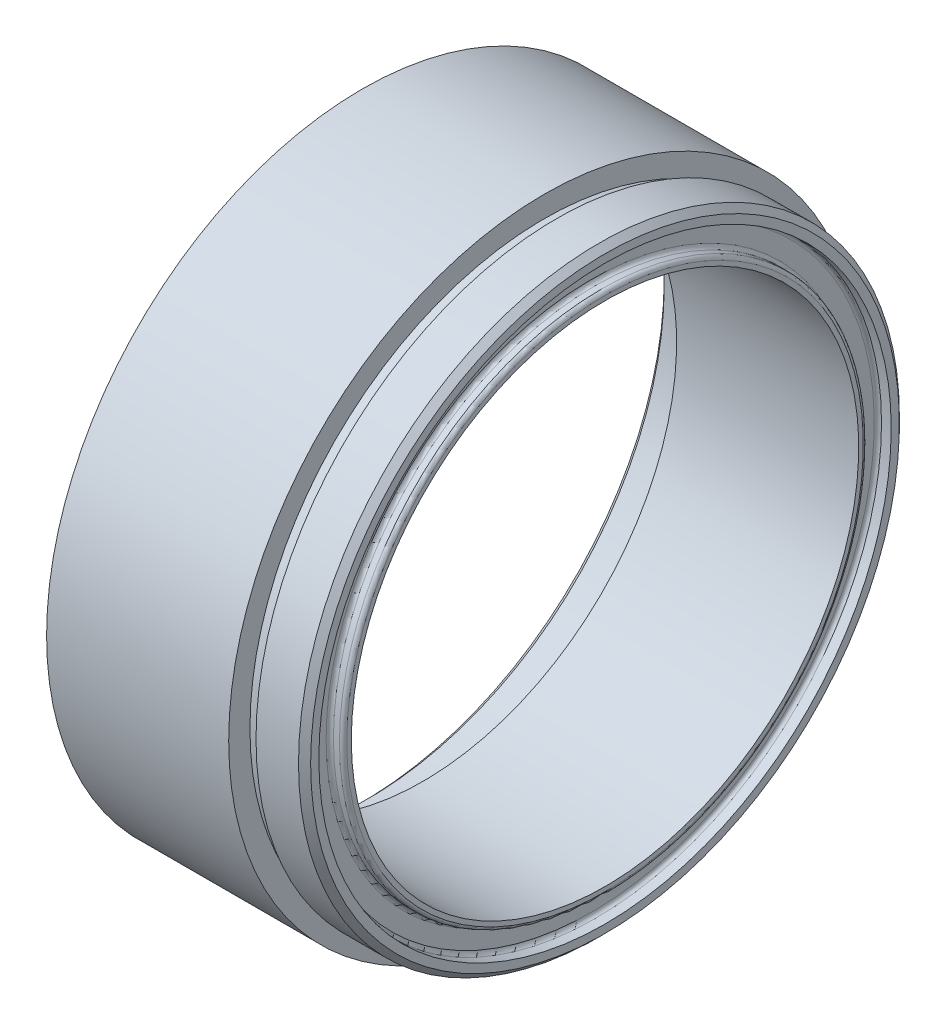
ISO-10303-21;
HEADER;
FILE_DESCRIPTION(('STEP AP214'),'2;1');
FILE_NAME('part.step','',(''),(''),'','','');
FILE_SCHEMA(('AUTOMOTIVE_DESIGN { 1 0 10303 214 1 1 1 1 }'));
ENDSEC;
DATA;
#1=APPLICATION_CONTEXT('core data for automotive mechanical design processes');
#2=APPLICATION_PROTOCOL_DEFINITION('international standard','automotive_design',2000,#1);
#3=PRODUCT_CONTEXT('',#1,'mechanical');
#4=PRODUCT('Part','Part','',(#3));
#5=PRODUCT_RELATED_PRODUCT_CATEGORY('part','',(#4));
#6=PRODUCT_DEFINITION_FORMATION('','',#4);
#7=PRODUCT_DEFINITION_CONTEXT('part definition',#1,'design');
#8=PRODUCT_DEFINITION('design','',#6,#7);
#9=PRODUCT_DEFINITION_SHAPE('','',#8);
#10=(LENGTH_UNIT() NAMED_UNIT(*) SI_UNIT(.MILLI.,.METRE.));
#11=(NAMED_UNIT(*) PLANE_ANGLE_UNIT() SI_UNIT($,.RADIAN.));
#12=(NAMED_UNIT(*) SI_UNIT($,.STERADIAN.) SOLID_ANGLE_UNIT());
#13=UNCERTAINTY_MEASURE_WITH_UNIT(LENGTH_MEASURE(1.E-05),#10,'distance_accuracy_value','');
#14=(GEOMETRIC_REPRESENTATION_CONTEXT(3) GLOBAL_UNCERTAINTY_ASSIGNED_CONTEXT((#13)) GLOBAL_UNIT_ASSIGNED_CONTEXT((#10,
#11,#12)) REPRESENTATION_CONTEXT('',''));
#15=CARTESIAN_POINT('',(0.,0.,0.));
#16=DIRECTION('',(0.,0.,1.));
#17=DIRECTION('',(1.,0.,0.));
#18=AXIS2_PLACEMENT_3D('',#15,#16,#17);
#19=CARTESIAN_POINT('',(9.99999999999999,26.,0.));
#20=DIRECTION('',(-1.,0.,0.));
#21=DIRECTION('',(0.,0.,1.));
#22=AXIS2_PLACEMENT_3D('',#19,#20,#21);
#23=PLANE('',#22);
#24=CARTESIAN_POINT('',(9.99999999999999,0.,0.));
#25=DIRECTION('',(-1.,0.,0.));
#26=DIRECTION('',(0.,0.,1.));
#27=AXIS2_PLACEMENT_3D('',#24,#25,#26);
#28=CIRCLE('',#27,26.);
#29=CARTESIAN_POINT('',(9.99999999999999,0.,26.));
#30=VERTEX_POINT('',#29);
#31=EDGE_CURVE('E77',#30,#30,#28,.T.);
#32=ORIENTED_EDGE('',*,*,#31,.F.);
#33=EDGE_LOOP('',(#32));
#34=FACE_BOUND('',#33,.T.);
#35=CARTESIAN_POINT('',(9.99999999999999,0.,0.));
#36=DIRECTION('',(-1.,0.,0.));
#37=DIRECTION('',(0.,0.,1.));
#38=AXIS2_PLACEMENT_3D('',#35,#36,#37);
#39=CIRCLE('',#38,24.25);
#40=CARTESIAN_POINT('',(9.99999999999999,0.,24.25));
#41=VERTEX_POINT('',#40);
#42=EDGE_CURVE('E107',#41,#41,#39,.T.);
#43=ORIENTED_EDGE('',*,*,#42,.T.);
#44=EDGE_LOOP('',(#43));
#45=FACE_BOUND('',#44,.T.);
#46=ADVANCED_FACE('F38',(#34,#45),#23,.F.);
#47=CARTESIAN_POINT('',(0.,0.,0.));
#48=DIRECTION('',(-1.,0.,0.));
#49=DIRECTION('',(0.,0.,1.));
#50=AXIS2_PLACEMENT_3D('',#47,#48,#49);
#51=CYLINDRICAL_SURFACE('',#50,26.);
#52=CARTESIAN_POINT('',(-5.00000000000001,0.,0.));
#53=DIRECTION('',(-1.,0.,0.));
#54=DIRECTION('',(0.,0.,1.));
#55=AXIS2_PLACEMENT_3D('',#52,#53,#54);
#56=CIRCLE('',#55,26.);
#57=CARTESIAN_POINT('',(-5.00000000000001,0.,26.));
#58=VERTEX_POINT('',#57);
#59=EDGE_CURVE('E80',#58,#58,#56,.T.);
#60=ORIENTED_EDGE('',*,*,#59,.F.);
#61=EDGE_LOOP('',(#60));
#62=FACE_BOUND('',#61,.T.);
#63=ORIENTED_EDGE('',*,*,#31,.T.);
#64=EDGE_LOOP('',(#63));
#65=FACE_BOUND('',#64,.T.);
#66=ADVANCED_FACE('F135',(#62,#65),#51,.T.);
#67=CARTESIAN_POINT('',(-5.00000000000001,24.375,0.));
#68=DIRECTION('',(1.,0.,0.));
#69=DIRECTION('',(0.,0.,-1.));
#70=AXIS2_PLACEMENT_3D('',#67,#68,#69);
#71=PLANE('',#70);
#72=CARTESIAN_POINT('',(-5.00000000000001,0.,0.));
#73=DIRECTION('',(1.,0.,0.));
#74=DIRECTION('',(0.,0.,-1.));
#75=AXIS2_PLACEMENT_3D('',#72,#73,#74);
#76=CIRCLE('',#75,24.875);
#77=CARTESIAN_POINT('',(-5.00000000000001,0.,-24.875));
#78=VERTEX_POINT('',#77);
#79=EDGE_CURVE('E71',#78,#78,#76,.T.);
#80=ORIENTED_EDGE('',*,*,#79,.T.);
#81=EDGE_LOOP('',(#80));
#82=FACE_BOUND('',#81,.T.);
#83=ORIENTED_EDGE('',*,*,#59,.T.);
#84=EDGE_LOOP('',(#83));
#85=FACE_BOUND('',#84,.T.);
#86=ADVANCED_FACE('F141',(#82,#85),#71,.F.);
#87=CARTESIAN_POINT('',(0.,0.,0.));
#88=DIRECTION('',(-1.,0.,0.));
#89=DIRECTION('',(0.,0.,1.));
#90=AXIS2_PLACEMENT_3D('',#87,#88,#89);
#91=CYLINDRICAL_SURFACE('',#90,24.375);
#92=CARTESIAN_POINT('',(-4.49999999999999,0.,0.));
#93=DIRECTION('',(1.,0.,0.));
#94=DIRECTION('',(0.,0.,-1.));
#95=AXIS2_PLACEMENT_3D('',#92,#93,#94);
#96=CIRCLE('',#95,24.375);
#97=CARTESIAN_POINT('',(-4.49999999999999,0.,-24.375));
#98=VERTEX_POINT('',#97);
#99=EDGE_CURVE('E74',#98,#98,#96,.F.);
#100=ORIENTED_EDGE('',*,*,#99,.T.);
#101=EDGE_LOOP('',(#100));
#102=FACE_BOUND('',#101,.T.);
#103=CARTESIAN_POINT('',(-0.500000000000005,0.,0.));
#104=DIRECTION('',(-1.,0.,0.));
#105=DIRECTION('',(0.,0.,1.));
#106=AXIS2_PLACEMENT_3D('',#103,#104,#105);
#107=CIRCLE('',#106,24.375);
#108=CARTESIAN_POINT('',(-0.500000000000005,0.,24.375));
#109=VERTEX_POINT('',#108);
#110=EDGE_CURVE('E83',#109,#109,#107,.T.);
#111=ORIENTED_EDGE('',*,*,#110,.F.);
#112=EDGE_LOOP('',(#111));
#113=FACE_BOUND('',#112,.T.);
#114=ADVANCED_FACE('F206',(#102,#113),#91,.F.);
#115=CARTESIAN_POINT('',(-0.500000000000005,24.375,0.));
#116=DIRECTION('',(-1.,0.,0.));
#117=DIRECTION('',(0.,0.,1.));
#118=AXIS2_PLACEMENT_3D('',#115,#116,#117);
#119=PLANE('',#118);
#120=CARTESIAN_POINT('',(-0.500000000000005,0.,0.));
#121=DIRECTION('',(-1.,0.,0.));
#122=DIRECTION('',(0.,0.,1.));
#123=AXIS2_PLACEMENT_3D('',#120,#121,#122);
#124=CIRCLE('',#123,24.875);
#125=CARTESIAN_POINT('',(-0.500000000000005,0.,24.875));
#126=VERTEX_POINT('',#125);
#127=EDGE_CURVE('E86',#126,#126,#124,.T.);
#128=ORIENTED_EDGE('',*,*,#127,.F.);
#129=EDGE_LOOP('',(#128));
#130=FACE_BOUND('',#129,.T.);
#131=ORIENTED_EDGE('',*,*,#110,.T.);
#132=EDGE_LOOP('',(#131));
#133=FACE_BOUND('',#132,.T.);
#134=ADVANCED_FACE('F202',(#130,#133),#119,.F.);
#135=CARTESIAN_POINT('',(0.,0.,0.));
#136=DIRECTION('',(-1.,0.,0.));
#137=DIRECTION('',(0.,0.,1.));
#138=AXIS2_PLACEMENT_3D('',#135,#136,#137);
#139=CYLINDRICAL_SURFACE('',#138,24.875);
#140=CARTESIAN_POINT('',(0.,0.,0.));
#141=DIRECTION('',(-1.,0.,0.));
#142=DIRECTION('',(0.,0.,1.));
#143=AXIS2_PLACEMENT_3D('',#140,#141,#142);
#144=CIRCLE('',#143,24.875);
#145=CARTESIAN_POINT('',(0.,0.,24.875));
#146=VERTEX_POINT('',#145);
#147=EDGE_CURVE('E89',#146,#146,#144,.T.);
#148=ORIENTED_EDGE('',*,*,#147,.F.);
#149=EDGE_LOOP('',(#148));
#150=FACE_BOUND('',#149,.T.);
#151=ORIENTED_EDGE('',*,*,#127,.T.);
#152=EDGE_LOOP('',(#151));
#153=FACE_BOUND('',#152,.T.);
#154=ADVANCED_FACE('F198',(#150,#153),#139,.F.);
#155=CARTESIAN_POINT('',(0.,20.9,0.));
#156=DIRECTION('',(1.,0.,0.));
#157=DIRECTION('',(0.,0.,-1.));
#158=AXIS2_PLACEMENT_3D('',#155,#156,#157);
#159=PLANE('',#158);
#160=CARTESIAN_POINT('',(0.,0.,0.));
#161=DIRECTION('',(-1.,0.,0.));
#162=DIRECTION('',(0.,0.,1.));
#163=AXIS2_PLACEMENT_3D('',#160,#161,#162);
#164=CIRCLE('',#163,20.9);
#165=CARTESIAN_POINT('',(0.,0.,20.9));
#166=VERTEX_POINT('',#165);
#167=EDGE_CURVE('E92',#166,#166,#164,.T.);
#168=ORIENTED_EDGE('',*,*,#167,.F.);
#169=EDGE_LOOP('',(#168));
#170=FACE_BOUND('',#169,.T.);
#171=ORIENTED_EDGE('',*,*,#147,.T.);
#172=EDGE_LOOP('',(#171));
#173=FACE_BOUND('',#172,.T.);
#174=ADVANCED_FACE('F194',(#170,#173),#159,.F.);
#175=CARTESIAN_POINT('',(0.,0.,0.));
#176=DIRECTION('',(-1.,0.,0.));
#177=DIRECTION('',(0.,0.,1.));
#178=AXIS2_PLACEMENT_3D('',#175,#176,#177);
#179=CYLINDRICAL_SURFACE('',#178,20.9);
#180=CARTESIAN_POINT('',(15.,0.,0.));
#181=DIRECTION('',(-1.,0.,0.));
#182=DIRECTION('',(0.,0.,1.));
#183=AXIS2_PLACEMENT_3D('',#180,#181,#182);
#184=CIRCLE('',#183,20.9);
#185=CARTESIAN_POINT('',(15.,0.,20.9));
#186=VERTEX_POINT('',#185);
#187=EDGE_CURVE('E95',#186,#186,#184,.T.);
#188=ORIENTED_EDGE('',*,*,#187,.F.);
#189=EDGE_LOOP('',(#188));
#190=FACE_BOUND('',#189,.T.);
#191=ORIENTED_EDGE('',*,*,#167,.T.);
#192=EDGE_LOOP('',(#191));
#193=FACE_BOUND('',#192,.T.);
#194=ADVANCED_FACE('F190',(#190,#193),#179,.F.);
#195=CARTESIAN_POINT('',(15.,21.575,0.));
#196=DIRECTION('',(-1.,0.,0.));
#197=DIRECTION('',(0.,0.,1.));
#198=AXIS2_PLACEMENT_3D('',#195,#196,#197);
#199=PLANE('',#198);
#200=CARTESIAN_POINT('',(15.,0.,0.));
#201=DIRECTION('',(-1.,0.,0.));
#202=DIRECTION('',(0.,0.,1.));
#203=AXIS2_PLACEMENT_3D('',#200,#201,#202);
#204=CIRCLE('',#203,21.275);
#205=CARTESIAN_POINT('',(15.,0.,21.275));
#206=VERTEX_POINT('',#205);
#207=EDGE_CURVE('E62',#206,#206,#204,.F.);
#208=ORIENTED_EDGE('',*,*,#207,.T.);
#209=EDGE_LOOP('',(#208));
#210=FACE_BOUND('',#209,.T.);
#211=ORIENTED_EDGE('',*,*,#187,.T.);
#212=EDGE_LOOP('',(#211));
#213=FACE_BOUND('',#212,.T.);
#214=ADVANCED_FACE('F186',(#210,#213),#199,.F.);
#215=CARTESIAN_POINT('',(0.,0.,0.));
#216=DIRECTION('',(-1.,0.,0.));
#217=DIRECTION('',(0.,0.,1.));
#218=AXIS2_PLACEMENT_3D('',#215,#216,#217);
#219=CYLINDRICAL_SURFACE('',#218,21.575);
#220=CARTESIAN_POINT('',(14.7,0.,0.));
#221=DIRECTION('',(-1.,0.,0.));
#222=DIRECTION('',(0.,0.,1.));
#223=AXIS2_PLACEMENT_3D('',#220,#221,#222);
#224=CIRCLE('',#223,21.575);
#225=CARTESIAN_POINT('',(14.7,0.,21.575));
#226=VERTEX_POINT('',#225);
#227=EDGE_CURVE('E65',#226,#226,#224,.T.);
#228=ORIENTED_EDGE('',*,*,#227,.T.);
#229=EDGE_LOOP('',(#228));
#230=FACE_BOUND('',#229,.T.);
#231=CARTESIAN_POINT('',(14.2,0.,0.));
#232=DIRECTION('',(-1.,0.,0.));
#233=DIRECTION('',(0.,0.,1.));
#234=AXIS2_PLACEMENT_3D('',#231,#232,#233);
#235=CIRCLE('',#234,21.575);
#236=CARTESIAN_POINT('',(14.2,0.,21.575));
#237=VERTEX_POINT('',#236);
#238=EDGE_CURVE('E68',#237,#237,#235,.F.);
#239=ORIENTED_EDGE('',*,*,#238,.T.);
#240=EDGE_LOOP('',(#239));
#241=FACE_BOUND('',#240,.T.);
#242=ADVANCED_FACE('F180',(#230,#241),#219,.T.);
#243=CARTESIAN_POINT('',(13.9,23.575,0.));
#244=DIRECTION('',(-1.,0.,0.));
#245=DIRECTION('',(0.,0.,1.));
#246=AXIS2_PLACEMENT_3D('',#243,#244,#245);
#247=PLANE('',#246);
#248=CARTESIAN_POINT('',(13.9,0.,0.));
#249=DIRECTION('',(-1.,0.,0.));
#250=DIRECTION('',(0.,0.,1.));
#251=AXIS2_PLACEMENT_3D('',#248,#249,#250);
#252=CIRCLE('',#251,21.875);
#253=CARTESIAN_POINT('',(13.9,0.,21.875));
#254=VERTEX_POINT('',#253);
#255=EDGE_CURVE('E54',#254,#254,#252,.T.);
#256=ORIENTED_EDGE('',*,*,#255,.T.);
#257=EDGE_LOOP('',(#256));
#258=FACE_BOUND('',#257,.T.);
#259=CARTESIAN_POINT('',(13.9,0.,0.));
#260=DIRECTION('',(-1.,0.,0.));
#261=DIRECTION('',(0.,0.,1.));
#262=AXIS2_PLACEMENT_3D('',#259,#260,#261);
#263=CIRCLE('',#262,23.275);
#264=CARTESIAN_POINT('',(13.9,0.,23.275));
#265=VERTEX_POINT('',#264);
#266=EDGE_CURVE('E59',#265,#265,#263,.F.);
#267=ORIENTED_EDGE('',*,*,#266,.T.);
#268=EDGE_LOOP('',(#267));
#269=FACE_BOUND('',#268,.T.);
#270=ADVANCED_FACE('F173',(#258,#269),#247,.F.);
#271=CARTESIAN_POINT('',(0.,0.,0.));
#272=DIRECTION('',(-1.,0.,0.));
#273=DIRECTION('',(0.,0.,1.));
#274=AXIS2_PLACEMENT_3D('',#271,#272,#273);
#275=CYLINDRICAL_SURFACE('',#274,23.575);
#276=CARTESIAN_POINT('',(14.2,0.,0.));
#277=DIRECTION('',(-1.,0.,0.));
#278=DIRECTION('',(0.,0.,1.));
#279=AXIS2_PLACEMENT_3D('',#276,#277,#278);
#280=CIRCLE('',#279,23.575);
#281=CARTESIAN_POINT('',(14.2,0.,23.575));
#282=VERTEX_POINT('',#281);
#283=EDGE_CURVE('E50',#282,#282,#280,.T.);
#284=ORIENTED_EDGE('',*,*,#283,.T.);
#285=EDGE_LOOP('',(#284));
#286=FACE_BOUND('',#285,.T.);
#287=CARTESIAN_POINT('',(15.,0.,0.));
#288=DIRECTION('',(-1.,0.,0.));
#289=DIRECTION('',(0.,0.,1.));
#290=AXIS2_PLACEMENT_3D('',#287,#288,#289);
#291=CIRCLE('',#290,23.575);
#292=CARTESIAN_POINT('',(15.,0.,23.575));
#293=VERTEX_POINT('',#292);
#294=EDGE_CURVE('E98',#293,#293,#291,.T.);
#295=ORIENTED_EDGE('',*,*,#294,.F.);
#296=EDGE_LOOP('',(#295));
#297=FACE_BOUND('',#296,.T.);
#298=ADVANCED_FACE('F132',(#286,#297),#275,.F.);
#299=CARTESIAN_POINT('',(15.,24.75,0.));
#300=DIRECTION('',(-1.,0.,0.));
#301=DIRECTION('',(0.,0.,1.));
#302=AXIS2_PLACEMENT_3D('',#299,#300,#301);
#303=PLANE('',#302);
#304=CARTESIAN_POINT('',(15.,0.,0.));
#305=DIRECTION('',(-1.,0.,0.));
#306=DIRECTION('',(0.,0.,1.));
#307=AXIS2_PLACEMENT_3D('',#304,#305,#306);
#308=CIRCLE('',#307,24.25);
#309=CARTESIAN_POINT('',(15.,0.,24.25));
#310=VERTEX_POINT('',#309);
#311=EDGE_CURVE('E10',#310,#310,#308,.F.);
#312=ORIENTED_EDGE('',*,*,#311,.T.);
#313=EDGE_LOOP('',(#312));
#314=FACE_BOUND('',#313,.T.);
#315=ORIENTED_EDGE('',*,*,#294,.T.);
#316=EDGE_LOOP('',(#315));
#317=FACE_BOUND('',#316,.T.);
#318=ADVANCED_FACE('F127',(#314,#317),#303,.F.);
#319=CARTESIAN_POINT('',(0.,0.,0.));
#320=DIRECTION('',(-1.,0.,0.));
#321=DIRECTION('',(0.,0.,1.));
#322=AXIS2_PLACEMENT_3D('',#319,#320,#321);
#323=CYLINDRICAL_SURFACE('',#322,24.75);
#324=CARTESIAN_POINT('',(14.5,0.,0.));
#325=DIRECTION('',(-1.,0.,0.));
#326=DIRECTION('',(0.,0.,1.));
#327=AXIS2_PLACEMENT_3D('',#324,#325,#326);
#328=CIRCLE('',#327,24.75);
#329=CARTESIAN_POINT('',(14.5,0.,24.75));
#330=VERTEX_POINT('',#329);
#331=EDGE_CURVE('E46',#330,#330,#328,.T.);
#332=ORIENTED_EDGE('',*,*,#331,.T.);
#333=EDGE_LOOP('',(#332));
#334=FACE_BOUND('',#333,.T.);
#335=CARTESIAN_POINT('',(11.,0.,0.));
#336=DIRECTION('',(-1.,0.,0.));
#337=DIRECTION('',(0.,0.,1.));
#338=AXIS2_PLACEMENT_3D('',#335,#336,#337);
#339=CIRCLE('',#338,24.75);
#340=CARTESIAN_POINT('',(11.,0.,24.75));
#341=VERTEX_POINT('',#340);
#342=EDGE_CURVE('E101',#341,#341,#339,.T.);
#343=ORIENTED_EDGE('',*,*,#342,.F.);
#344=EDGE_LOOP('',(#343));
#345=FACE_BOUND('',#344,.T.);
#346=ADVANCED_FACE('F122',(#334,#345),#323,.T.);
#347=CARTESIAN_POINT('',(11.,24.25,0.));
#348=DIRECTION('',(1.,0.,0.));
#349=DIRECTION('',(0.,0.,-1.));
#350=AXIS2_PLACEMENT_3D('',#347,#348,#349);
#351=PLANE('',#350);
#352=CARTESIAN_POINT('',(11.,0.,0.));
#353=DIRECTION('',(-1.,0.,0.));
#354=DIRECTION('',(0.,0.,1.));
#355=AXIS2_PLACEMENT_3D('',#352,#353,#354);
#356=CIRCLE('',#355,24.25);
#357=CARTESIAN_POINT('',(11.,0.,24.25));
#358=VERTEX_POINT('',#357);
#359=EDGE_CURVE('E104',#358,#358,#356,.T.);
#360=ORIENTED_EDGE('',*,*,#359,.F.);
#361=EDGE_LOOP('',(#360));
#362=FACE_BOUND('',#361,.T.);
#363=ORIENTED_EDGE('',*,*,#342,.T.);
#364=EDGE_LOOP('',(#363));
#365=FACE_BOUND('',#364,.T.);
#366=ADVANCED_FACE('F116',(#362,#365),#351,.F.);
#367=CARTESIAN_POINT('',(0.,0.,0.));
#368=DIRECTION('',(-1.,0.,0.));
#369=DIRECTION('',(0.,0.,1.));
#370=AXIS2_PLACEMENT_3D('',#367,#368,#369);
#371=CYLINDRICAL_SURFACE('',#370,24.25);
#372=ORIENTED_EDGE('',*,*,#42,.F.);
#373=EDGE_LOOP('',(#372));
#374=FACE_BOUND('',#373,.T.);
#375=ORIENTED_EDGE('',*,*,#359,.T.);
#376=EDGE_LOOP('',(#375));
#377=FACE_BOUND('',#376,.T.);
#378=ADVANCED_FACE('F112',(#374,#377),#371,.T.);
#379=CARTESIAN_POINT('',(-4.49999999999999,0.,0.));
#380=DIRECTION('',(-1.,0.,0.));
#381=DIRECTION('',(0.,0.,1.));
#382=AXIS2_PLACEMENT_3D('',#379,#380,#381);
#383=CONICAL_SURFACE('',#382,24.375,0.785398163397455);
#384=ORIENTED_EDGE('',*,*,#79,.F.);
#385=EDGE_LOOP('',(#384));
#386=FACE_BOUND('',#385,.T.);
#387=ORIENTED_EDGE('',*,*,#99,.F.);
#388=EDGE_LOOP('',(#387));
#389=FACE_BOUND('',#388,.T.);
#390=ADVANCED_FACE('F115',(#386,#389),#383,.F.);
#391=CARTESIAN_POINT('',(14.7,0.,0.));
#392=DIRECTION('',(-1.,0.,0.));
#393=DIRECTION('',(0.,0.,1.));
#394=AXIS2_PLACEMENT_3D('',#391,#392,#393);
#395=TOROIDAL_SURFACE('',#394,21.275,0.3);
#396=ORIENTED_EDGE('',*,*,#207,.F.);
#397=EDGE_LOOP('',(#396));
#398=FACE_BOUND('',#397,.T.);
#399=ORIENTED_EDGE('',*,*,#227,.F.);
#400=EDGE_LOOP('',(#399));
#401=FACE_BOUND('',#400,.T.);
#402=ADVANCED_FACE('F152',(#398,#401),#395,.T.);
#403=CARTESIAN_POINT('',(14.2,0.,0.));
#404=DIRECTION('',(-1.,0.,0.));
#405=DIRECTION('',(0.,0.,1.));
#406=AXIS2_PLACEMENT_3D('',#403,#404,#405);
#407=TOROIDAL_SURFACE('',#406,21.875,0.3);
#408=ORIENTED_EDGE('',*,*,#238,.F.);
#409=EDGE_LOOP('',(#408));
#410=FACE_BOUND('',#409,.T.);
#411=ORIENTED_EDGE('',*,*,#255,.F.);
#412=EDGE_LOOP('',(#411));
#413=FACE_BOUND('',#412,.T.);
#414=ADVANCED_FACE('F156',(#410,#413),#407,.F.);
#415=CARTESIAN_POINT('',(14.2,0.,0.));
#416=DIRECTION('',(-1.,0.,0.));
#417=DIRECTION('',(0.,0.,1.));
#418=AXIS2_PLACEMENT_3D('',#415,#416,#417);
#419=TOROIDAL_SURFACE('',#418,23.275,0.3);
#420=ORIENTED_EDGE('',*,*,#266,.F.);
#421=EDGE_LOOP('',(#420));
#422=FACE_BOUND('',#421,.T.);
#423=ORIENTED_EDGE('',*,*,#283,.F.);
#424=EDGE_LOOP('',(#423));
#425=FACE_BOUND('',#424,.T.);
#426=ADVANCED_FACE('F159',(#422,#425),#419,.F.);
#427=CARTESIAN_POINT('',(14.5,0.,0.));
#428=DIRECTION('',(-1.,0.,0.));
#429=DIRECTION('',(0.,0.,1.));
#430=AXIS2_PLACEMENT_3D('',#427,#428,#429);
#431=CONICAL_SURFACE('',#430,24.75,0.785398163397455);
#432=ORIENTED_EDGE('',*,*,#311,.F.);
#433=EDGE_LOOP('',(#432));
#434=FACE_BOUND('',#433,.T.);
#435=ORIENTED_EDGE('',*,*,#331,.F.);
#436=EDGE_LOOP('',(#435));
#437=FACE_BOUND('',#436,.T.);
#438=ADVANCED_FACE('F41',(#434,#437),#431,.T.);
#439=CLOSED_SHELL('',(#46,#66,#86,#114,#134,#154,#174,#194,#214,#242,#270,#298,#318,#346,#366,
#378,#390,#402,#414,#426,#438));
#440=MANIFOLD_SOLID_BREP('B2',#439);
#441=ADVANCED_BREP_SHAPE_REPRESENTATION('',(#18,#440),#14);
#442=SHAPE_DEFINITION_REPRESENTATION(#9,#441);
ENDSEC;
END-ISO-10303-21;
